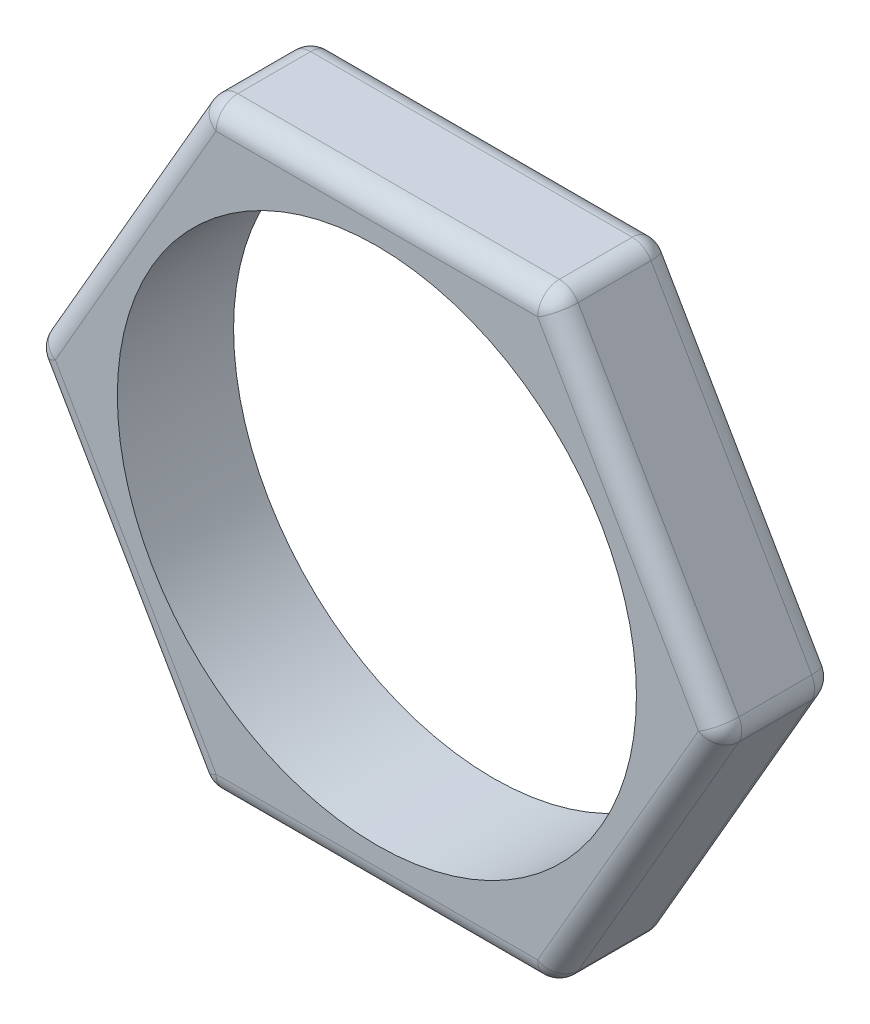
ISO-10303-21;
HEADER;
FILE_DESCRIPTION(('STEP AP214'),'2;1');
FILE_NAME('part.step','',(''),(''),'','','');
FILE_SCHEMA(('AUTOMOTIVE_DESIGN { 1 0 10303 214 1 1 1 1 }'));
ENDSEC;
DATA;
#1=APPLICATION_CONTEXT('core data for automotive mechanical design processes');
#2=APPLICATION_PROTOCOL_DEFINITION('international standard','automotive_design',2000,#1);
#3=PRODUCT_CONTEXT('',#1,'mechanical');
#4=PRODUCT('Part','Part','',(#3));
#5=PRODUCT_RELATED_PRODUCT_CATEGORY('part','',(#4));
#6=PRODUCT_DEFINITION_FORMATION('','',#4);
#7=PRODUCT_DEFINITION_CONTEXT('part definition',#1,'design');
#8=PRODUCT_DEFINITION('design','',#6,#7);
#9=PRODUCT_DEFINITION_SHAPE('','',#8);
#10=(LENGTH_UNIT() NAMED_UNIT(*) SI_UNIT(.MILLI.,.METRE.));
#11=(NAMED_UNIT(*) PLANE_ANGLE_UNIT() SI_UNIT($,.RADIAN.));
#12=(NAMED_UNIT(*) SI_UNIT($,.STERADIAN.) SOLID_ANGLE_UNIT());
#13=UNCERTAINTY_MEASURE_WITH_UNIT(LENGTH_MEASURE(1.E-05),#10,'distance_accuracy_value','');
#14=(GEOMETRIC_REPRESENTATION_CONTEXT(3) GLOBAL_UNCERTAINTY_ASSIGNED_CONTEXT((#13)) GLOBAL_UNIT_ASSIGNED_CONTEXT((#10,
#11,#12)) REPRESENTATION_CONTEXT('',''));
#15=CARTESIAN_POINT('',(0.,0.,0.));
#16=DIRECTION('',(0.,0.,1.));
#17=DIRECTION('',(1.,0.,0.));
#18=AXIS2_PLACEMENT_3D('',#15,#16,#17);
#19=CARTESIAN_POINT('',(5.88420960601336,-10.19175,0.));
#20=DIRECTION('',(0.,0.,-1.));
#21=DIRECTION('',(-1.,0.,0.));
#22=AXIS2_PLACEMENT_3D('',#19,#20,#21);
#23=CYLINDRICAL_SURFACE('',#22,0.79375);
#24=CARTESIAN_POINT('',(5.88420960601336,-10.19175,-0.79375));
#25=DIRECTION('',(0.,0.,-1.));
#26=DIRECTION('',(-1.,0.,0.));
#27=AXIS2_PLACEMENT_3D('',#24,#25,#26);
#28=CIRCLE('',#27,0.79375);
#29=CARTESIAN_POINT('',(5.88420960601336,-10.9855,-0.79375));
#30=VERTEX_POINT('',#29);
#31=CARTESIAN_POINT('',(6.57161727026726,-10.588625,-0.79375));
#32=VERTEX_POINT('',#31);
#33=EDGE_CURVE('E382',#30,#32,#28,.F.);
#34=ORIENTED_EDGE('',*,*,#33,.F.);
#35=DIRECTION('',(0.,0.,-1.));
#36=VECTOR('',#35,1.);
#37=CARTESIAN_POINT('',(5.88420960601336,-10.9855,0.));
#38=LINE('',#37,#36);
#39=CARTESIAN_POINT('',(5.88420960601336,-10.9855,-3.46075));
#40=VERTEX_POINT('',#39);
#41=EDGE_CURVE('E385',#40,#30,#38,.F.);
#42=ORIENTED_EDGE('',*,*,#41,.F.);
#43=CARTESIAN_POINT('',(5.88420960601336,-10.19175,-3.46075));
#44=DIRECTION('',(0.,0.,-1.));
#45=DIRECTION('',(-1.,0.,0.));
#46=AXIS2_PLACEMENT_3D('',#43,#44,#45);
#47=CIRCLE('',#46,0.79375);
#48=CARTESIAN_POINT('',(6.57161727026726,-10.588625,-3.46075));
#49=VERTEX_POINT('',#48);
#50=EDGE_CURVE('E507',#49,#40,#47,.T.);
#51=ORIENTED_EDGE('',*,*,#50,.F.);
#52=DIRECTION('',(0.,0.,1.));
#53=VECTOR('',#52,1.);
#54=CARTESIAN_POINT('',(6.57161727026726,-10.588625,0.));
#55=LINE('',#54,#53);
#56=EDGE_CURVE('E372',#32,#49,#55,.F.);
#57=ORIENTED_EDGE('',*,*,#56,.F.);
#58=EDGE_LOOP('',(#34,#42,#51,#57));
#59=FACE_BOUND('',#58,.T.);
#60=ADVANCED_FACE('F17',(#59),#23,.T.);
#61=CARTESIAN_POINT('',(11.7684192120267,0.,0.));
#62=DIRECTION('',(0.,0.,-1.));
#63=DIRECTION('',(-1.,0.,0.));
#64=AXIS2_PLACEMENT_3D('',#61,#62,#63);
#65=CYLINDRICAL_SURFACE('',#64,0.79375);
#66=CARTESIAN_POINT('',(11.7684192120267,0.,-0.79375));
#67=DIRECTION('',(0.,0.,-1.));
#68=DIRECTION('',(-1.,0.,0.));
#69=AXIS2_PLACEMENT_3D('',#66,#67,#68);
#70=CIRCLE('',#69,0.79375);
#71=CARTESIAN_POINT('',(12.4558268762806,-0.396875000000004,-0.79375));
#72=VERTEX_POINT('',#71);
#73=CARTESIAN_POINT('',(12.4558268762806,0.396874999999995,-0.79375));
#74=VERTEX_POINT('',#73);
#75=EDGE_CURVE('E374',#72,#74,#70,.F.);
#76=ORIENTED_EDGE('',*,*,#75,.F.);
#77=DIRECTION('',(0.,0.,1.));
#78=VECTOR('',#77,1.);
#79=CARTESIAN_POINT('',(12.4558268762806,-0.396875000000005,0.));
#80=LINE('',#79,#78);
#81=CARTESIAN_POINT('',(12.4558268762806,-0.396875000000005,-3.46075));
#82=VERTEX_POINT('',#81);
#83=EDGE_CURVE('E375',#82,#72,#80,.T.);
#84=ORIENTED_EDGE('',*,*,#83,.F.);
#85=CARTESIAN_POINT('',(11.7684192120267,0.,-3.46075));
#86=DIRECTION('',(0.,0.,-1.));
#87=DIRECTION('',(-1.,0.,0.));
#88=AXIS2_PLACEMENT_3D('',#85,#86,#87);
#89=CIRCLE('',#88,0.79375);
#90=CARTESIAN_POINT('',(12.4558268762806,0.396874999999995,-3.46075));
#91=VERTEX_POINT('',#90);
#92=EDGE_CURVE('E453',#91,#82,#89,.T.);
#93=ORIENTED_EDGE('',*,*,#92,.F.);
#94=DIRECTION('',(0.,0.,1.));
#95=VECTOR('',#94,1.);
#96=CARTESIAN_POINT('',(12.4558268762806,0.396874999999994,0.));
#97=LINE('',#96,#95);
#98=EDGE_CURVE('E462',#74,#91,#97,.F.);
#99=ORIENTED_EDGE('',*,*,#98,.F.);
#100=EDGE_LOOP('',(#76,#84,#93,#99));
#101=FACE_BOUND('',#100,.T.);
#102=ADVANCED_FACE('F209',(#101),#65,.T.);
#103=CARTESIAN_POINT('',(5.88420960601336,10.19175,0.));
#104=DIRECTION('',(0.,0.,-1.));
#105=DIRECTION('',(-1.,0.,0.));
#106=AXIS2_PLACEMENT_3D('',#103,#104,#105);
#107=CYLINDRICAL_SURFACE('',#106,0.79375);
#108=CARTESIAN_POINT('',(5.88420960601336,10.19175,-0.79375));
#109=DIRECTION('',(0.,0.,-1.));
#110=DIRECTION('',(-1.,0.,0.));
#111=AXIS2_PLACEMENT_3D('',#108,#109,#110);
#112=CIRCLE('',#111,0.79375);
#113=CARTESIAN_POINT('',(6.57161727026726,10.588625,-0.79375));
#114=VERTEX_POINT('',#113);
#115=CARTESIAN_POINT('',(5.88420960601336,10.9855,-0.79375));
#116=VERTEX_POINT('',#115);
#117=EDGE_CURVE('E348',#114,#116,#112,.F.);
#118=ORIENTED_EDGE('',*,*,#117,.F.);
#119=DIRECTION('',(0.,0.,1.));
#120=VECTOR('',#119,1.);
#121=CARTESIAN_POINT('',(6.57161727026726,10.588625,0.));
#122=LINE('',#121,#120);
#123=CARTESIAN_POINT('',(6.57161727026726,10.588625,-3.46075));
#124=VERTEX_POINT('',#123);
#125=EDGE_CURVE('E370',#124,#114,#122,.T.);
#126=ORIENTED_EDGE('',*,*,#125,.F.);
#127=CARTESIAN_POINT('',(5.88420960601336,10.19175,-3.46075));
#128=DIRECTION('',(0.,0.,-1.));
#129=DIRECTION('',(-1.,0.,0.));
#130=AXIS2_PLACEMENT_3D('',#127,#128,#129);
#131=CIRCLE('',#130,0.79375);
#132=CARTESIAN_POINT('',(5.88420960601336,10.9855,-3.46075));
#133=VERTEX_POINT('',#132);
#134=EDGE_CURVE('E447',#133,#124,#131,.T.);
#135=ORIENTED_EDGE('',*,*,#134,.F.);
#136=DIRECTION('',(0.,0.,1.));
#137=VECTOR('',#136,1.);
#138=CARTESIAN_POINT('',(5.88420960601336,10.9855,0.));
#139=LINE('',#138,#137);
#140=EDGE_CURVE('E340',#116,#133,#139,.F.);
#141=ORIENTED_EDGE('',*,*,#140,.F.);
#142=EDGE_LOOP('',(#118,#126,#135,#141));
#143=FACE_BOUND('',#142,.T.);
#144=ADVANCED_FACE('F206',(#143),#107,.T.);
#145=CARTESIAN_POINT('',(-5.88420960601338,10.19175,0.));
#146=DIRECTION('',(0.,0.,-1.));
#147=DIRECTION('',(-1.,0.,0.));
#148=AXIS2_PLACEMENT_3D('',#145,#146,#147);
#149=CYLINDRICAL_SURFACE('',#148,0.79375);
#150=CARTESIAN_POINT('',(-5.88420960601338,10.19175,-0.79375));
#151=DIRECTION('',(0.,0.,-1.));
#152=DIRECTION('',(-1.,0.,0.));
#153=AXIS2_PLACEMENT_3D('',#150,#151,#152);
#154=CIRCLE('',#153,0.79375);
#155=CARTESIAN_POINT('',(-5.88420960601338,10.9855,-0.79375));
#156=VERTEX_POINT('',#155);
#157=CARTESIAN_POINT('',(-6.57161727026727,10.588625,-0.79375));
#158=VERTEX_POINT('',#157);
#159=EDGE_CURVE('E176',#156,#158,#154,.F.);
#160=ORIENTED_EDGE('',*,*,#159,.F.);
#161=DIRECTION('',(0.,0.,1.));
#162=VECTOR('',#161,1.);
#163=CARTESIAN_POINT('',(-5.88420960601338,10.9855,0.));
#164=LINE('',#163,#162);
#165=CARTESIAN_POINT('',(-5.88420960601338,10.9855,-3.46075));
#166=VERTEX_POINT('',#165);
#167=EDGE_CURVE('E342',#166,#156,#164,.T.);
#168=ORIENTED_EDGE('',*,*,#167,.F.);
#169=CARTESIAN_POINT('',(-5.88420960601338,10.19175,-3.46075));
#170=DIRECTION('',(0.,0.,-1.));
#171=DIRECTION('',(-1.,0.,0.));
#172=AXIS2_PLACEMENT_3D('',#169,#170,#171);
#173=CIRCLE('',#172,0.79375);
#174=CARTESIAN_POINT('',(-6.57161727026726,10.588625,-3.46075));
#175=VERTEX_POINT('',#174);
#176=EDGE_CURVE('E159',#175,#166,#173,.T.);
#177=ORIENTED_EDGE('',*,*,#176,.F.);
#178=DIRECTION('',(0.,0.,1.));
#179=VECTOR('',#178,1.);
#180=CARTESIAN_POINT('',(-6.57161727026726,10.588625,0.));
#181=LINE('',#180,#179);
#182=EDGE_CURVE('E175',#158,#175,#181,.F.);
#183=ORIENTED_EDGE('',*,*,#182,.F.);
#184=EDGE_LOOP('',(#160,#168,#177,#183));
#185=FACE_BOUND('',#184,.T.);
#186=ADVANCED_FACE('F202',(#185),#149,.T.);
#187=CARTESIAN_POINT('',(-5.88420960601336,-10.19175,0.));
#188=DIRECTION('',(0.,0.,-1.));
#189=DIRECTION('',(-1.,0.,0.));
#190=AXIS2_PLACEMENT_3D('',#187,#188,#189);
#191=CYLINDRICAL_SURFACE('',#190,0.79375);
#192=CARTESIAN_POINT('',(-5.88420960601336,-10.19175,-0.79375));
#193=DIRECTION('',(0.,0.,-1.));
#194=DIRECTION('',(-1.,0.,0.));
#195=AXIS2_PLACEMENT_3D('',#192,#193,#194);
#196=CIRCLE('',#195,0.79375);
#197=CARTESIAN_POINT('',(-6.57161727026727,-10.588625,-0.79375));
#198=VERTEX_POINT('',#197);
#199=CARTESIAN_POINT('',(-5.88420960601336,-10.9855,-0.79375));
#200=VERTEX_POINT('',#199);
#201=EDGE_CURVE('E501',#198,#200,#196,.F.);
#202=ORIENTED_EDGE('',*,*,#201,.F.);
#203=DIRECTION('',(0.,0.,1.));
#204=VECTOR('',#203,1.);
#205=CARTESIAN_POINT('',(-6.57161727026726,-10.588625,0.));
#206=LINE('',#205,#204);
#207=CARTESIAN_POINT('',(-6.57161727026727,-10.588625,-3.46075));
#208=VERTEX_POINT('',#207);
#209=EDGE_CURVE('E302',#208,#198,#206,.T.);
#210=ORIENTED_EDGE('',*,*,#209,.F.);
#211=CARTESIAN_POINT('',(-5.88420960601336,-10.19175,-3.46075));
#212=DIRECTION('',(0.,0.,-1.));
#213=DIRECTION('',(-1.,0.,0.));
#214=AXIS2_PLACEMENT_3D('',#211,#212,#213);
#215=CIRCLE('',#214,0.79375);
#216=CARTESIAN_POINT('',(-5.88420960601336,-10.9855,-3.46075));
#217=VERTEX_POINT('',#216);
#218=EDGE_CURVE('E392',#217,#208,#215,.T.);
#219=ORIENTED_EDGE('',*,*,#218,.F.);
#220=DIRECTION('',(0.,0.,-1.));
#221=VECTOR('',#220,1.);
#222=CARTESIAN_POINT('',(-5.88420960601336,-10.9855,0.));
#223=LINE('',#222,#221);
#224=EDGE_CURVE('E383',#200,#217,#223,.T.);
#225=ORIENTED_EDGE('',*,*,#224,.F.);
#226=EDGE_LOOP('',(#202,#210,#219,#225));
#227=FACE_BOUND('',#226,.T.);
#228=ADVANCED_FACE('F199',(#227),#191,.T.);
#229=CARTESIAN_POINT('',(-11.7684192120267,0.,0.));
#230=DIRECTION('',(0.,0.,-1.));
#231=DIRECTION('',(-1.,0.,0.));
#232=AXIS2_PLACEMENT_3D('',#229,#230,#231);
#233=CYLINDRICAL_SURFACE('',#232,0.79375);
#234=CARTESIAN_POINT('',(-11.7684192120267,0.,-0.79375));
#235=DIRECTION('',(0.,0.,-1.));
#236=DIRECTION('',(-1.,0.,0.));
#237=AXIS2_PLACEMENT_3D('',#234,#235,#236);
#238=CIRCLE('',#237,0.79375);
#239=CARTESIAN_POINT('',(-12.4558268762806,0.396874999999993,-0.79375));
#240=VERTEX_POINT('',#239);
#241=CARTESIAN_POINT('',(-12.4558268762806,-0.396875000000001,-0.79375));
#242=VERTEX_POINT('',#241);
#243=EDGE_CURVE('E172',#240,#242,#238,.F.);
#244=ORIENTED_EDGE('',*,*,#243,.F.);
#245=DIRECTION('',(0.,0.,1.));
#246=VECTOR('',#245,1.);
#247=CARTESIAN_POINT('',(-12.4558268762806,0.396874999999995,0.));
#248=LINE('',#247,#246);
#249=CARTESIAN_POINT('',(-12.4558268762806,0.396874999999992,-3.46075));
#250=VERTEX_POINT('',#249);
#251=EDGE_CURVE('E170',#250,#240,#248,.T.);
#252=ORIENTED_EDGE('',*,*,#251,.F.);
#253=CARTESIAN_POINT('',(-11.7684192120267,0.,-3.46075));
#254=DIRECTION('',(0.,0.,-1.));
#255=DIRECTION('',(-1.,0.,0.));
#256=AXIS2_PLACEMENT_3D('',#253,#254,#255);
#257=CIRCLE('',#256,0.79375);
#258=CARTESIAN_POINT('',(-12.4558268762806,-0.396875000000002,-3.46075));
#259=VERTEX_POINT('',#258);
#260=EDGE_CURVE('E20',#259,#250,#257,.T.);
#261=ORIENTED_EDGE('',*,*,#260,.F.);
#262=DIRECTION('',(0.,0.,1.));
#263=VECTOR('',#262,1.);
#264=CARTESIAN_POINT('',(-12.4558268762806,-0.396875000000003,0.));
#265=LINE('',#264,#263);
#266=EDGE_CURVE('E145',#242,#259,#265,.F.);
#267=ORIENTED_EDGE('',*,*,#266,.F.);
#268=EDGE_LOOP('',(#244,#252,#261,#267));
#269=FACE_BOUND('',#268,.T.);
#270=ADVANCED_FACE('F171',(#269),#233,.T.);
#271=CARTESIAN_POINT('',(-11.7684192120267,0.,-3.46075));
#272=DIRECTION('',(-0.866025403784439,0.,-0.5));
#273=DIRECTION('',(0.,1.,0.));
#274=AXIS2_PLACEMENT_3D('',#271,#272,#273);
#275=SPHERICAL_SURFACE('',#274,0.79375);
#276=CARTESIAN_POINT('',(-12.4558268762806,0.,-3.857625));
#277=VERTEX_POINT('',#276);
#278=VERTEX_LOOP('',#277);
#279=FACE_BOUND('',#278,.T.);
#280=ORIENTED_EDGE('',*,*,#260,.T.);
#281=CARTESIAN_POINT('',(-11.7684192120267,0.,-3.46075));
#282=DIRECTION('',(0.5,0.866025403784439,0.));
#283=DIRECTION('',(-0.866025403784439,0.5,0.));
#284=AXIS2_PLACEMENT_3D('',#281,#282,#283);
#285=CIRCLE('',#284,0.79375);
#286=CARTESIAN_POINT('',(-11.7684192120267,0.,-4.2545));
#287=VERTEX_POINT('',#286);
#288=EDGE_CURVE('E154',#287,#250,#285,.T.);
#289=ORIENTED_EDGE('',*,*,#288,.F.);
#290=CARTESIAN_POINT('',(-11.7684192120267,0.,-3.46075));
#291=DIRECTION('',(-0.5,0.866025403784439,0.));
#292=DIRECTION('',(-0.866025403784439,-0.5,0.));
#293=AXIS2_PLACEMENT_3D('',#290,#291,#292);
#294=CIRCLE('',#293,0.79375);
#295=EDGE_CURVE('E156',#259,#287,#294,.F.);
#296=ORIENTED_EDGE('',*,*,#295,.F.);
#297=EDGE_LOOP('',(#280,#289,#296));
#298=FACE_BOUND('',#297,.T.);
#299=ADVANCED_FACE('F153',(#279,#298),#275,.T.);
#300=CARTESIAN_POINT('',(-5.88420960601338,10.19175,-3.46075));
#301=DIRECTION('',(-0.43301270189222,0.75,-0.499999999999999));
#302=DIRECTION('',(0.,-0.554700196225228,-0.832050294337844));
#303=AXIS2_PLACEMENT_3D('',#300,#301,#302);
#304=SPHERICAL_SURFACE('',#303,0.79375);
#305=CARTESIAN_POINT('',(-6.22791343814033,10.7870625,-3.857625));
#306=VERTEX_POINT('',#305);
#307=VERTEX_LOOP('',#306);
#308=FACE_BOUND('',#307,.T.);
#309=ORIENTED_EDGE('',*,*,#176,.T.);
#310=CARTESIAN_POINT('',(-5.88420960601338,10.19175,-3.46075));
#311=DIRECTION('',(1.,0.,0.));
#312=DIRECTION('',(0.,1.,0.));
#313=AXIS2_PLACEMENT_3D('',#310,#311,#312);
#314=CIRCLE('',#313,0.79375);
#315=CARTESIAN_POINT('',(-5.88420960601338,10.19175,-4.2545));
#316=VERTEX_POINT('',#315);
#317=EDGE_CURVE('E182',#316,#166,#314,.T.);
#318=ORIENTED_EDGE('',*,*,#317,.F.);
#319=CARTESIAN_POINT('',(-5.88420960601336,10.19175,-3.46075));
#320=DIRECTION('',(0.5,0.866025403784439,0.));
#321=DIRECTION('',(-0.866025403784439,0.5,0.));
#322=AXIS2_PLACEMENT_3D('',#319,#320,#321);
#323=CIRCLE('',#322,0.79375);
#324=EDGE_CURVE('E180',#175,#316,#323,.F.);
#325=ORIENTED_EDGE('',*,*,#324,.F.);
#326=EDGE_LOOP('',(#309,#318,#325));
#327=FACE_BOUND('',#326,.T.);
#328=ADVANCED_FACE('F194',(#308,#327),#304,.T.);
#329=CARTESIAN_POINT('',(5.88420960601336,10.19175,-3.46075));
#330=DIRECTION('',(0.43301270189222,0.75,-0.499999999999999));
#331=DIRECTION('',(0.,-0.554700196225228,-0.832050294337844));
#332=AXIS2_PLACEMENT_3D('',#329,#330,#331);
#333=SPHERICAL_SURFACE('',#332,0.79375);
#334=CARTESIAN_POINT('',(6.22791343814031,10.7870625,-3.857625));
#335=VERTEX_POINT('',#334);
#336=VERTEX_LOOP('',#335);
#337=FACE_BOUND('',#336,.T.);
#338=ORIENTED_EDGE('',*,*,#134,.T.);
#339=CARTESIAN_POINT('',(5.88420960601335,10.19175,-3.46075));
#340=DIRECTION('',(0.5,-0.866025403784439,0.));
#341=DIRECTION('',(0.866025403784439,0.5,0.));
#342=AXIS2_PLACEMENT_3D('',#339,#340,#341);
#343=CIRCLE('',#342,0.79375);
#344=CARTESIAN_POINT('',(5.88420960601336,10.19175,-4.2545));
#345=VERTEX_POINT('',#344);
#346=EDGE_CURVE('E428',#345,#124,#343,.T.);
#347=ORIENTED_EDGE('',*,*,#346,.F.);
#348=CARTESIAN_POINT('',(5.88420960601336,10.19175,-3.46075));
#349=DIRECTION('',(1.,0.,0.));
#350=DIRECTION('',(0.,1.,0.));
#351=AXIS2_PLACEMENT_3D('',#348,#349,#350);
#352=CIRCLE('',#351,0.79375);
#353=EDGE_CURVE('E450',#133,#345,#352,.F.);
#354=ORIENTED_EDGE('',*,*,#353,.F.);
#355=EDGE_LOOP('',(#338,#347,#354));
#356=FACE_BOUND('',#355,.T.);
#357=ADVANCED_FACE('F432',(#337,#356),#333,.T.);
#358=CARTESIAN_POINT('',(11.7684192120267,0.,-3.46075));
#359=DIRECTION('',(0.866025403784439,0.,-0.5));
#360=DIRECTION('',(0.,-1.,0.));
#361=AXIS2_PLACEMENT_3D('',#358,#359,#360);
#362=SPHERICAL_SURFACE('',#361,0.79375);
#363=CARTESIAN_POINT('',(12.4558268762806,0.,-3.857625));
#364=VERTEX_POINT('',#363);
#365=VERTEX_LOOP('',#364);
#366=FACE_BOUND('',#365,.T.);
#367=ORIENTED_EDGE('',*,*,#92,.T.);
#368=CARTESIAN_POINT('',(11.7684192120267,0.,-3.46075));
#369=DIRECTION('',(-0.5,-0.866025403784439,0.));
#370=DIRECTION('',(0.866025403784439,-0.5,0.));
#371=AXIS2_PLACEMENT_3D('',#368,#369,#370);
#372=CIRCLE('',#371,0.79375);
#373=CARTESIAN_POINT('',(11.7684192120267,0.,-4.2545));
#374=VERTEX_POINT('',#373);
#375=EDGE_CURVE('E418',#374,#82,#372,.T.);
#376=ORIENTED_EDGE('',*,*,#375,.F.);
#377=CARTESIAN_POINT('',(11.7684192120267,0.,-3.46075));
#378=DIRECTION('',(0.5,-0.866025403784439,0.));
#379=DIRECTION('',(0.866025403784439,0.5,0.));
#380=AXIS2_PLACEMENT_3D('',#377,#378,#379);
#381=CIRCLE('',#380,0.79375);
#382=EDGE_CURVE('E427',#91,#374,#381,.F.);
#383=ORIENTED_EDGE('',*,*,#382,.F.);
#384=EDGE_LOOP('',(#367,#376,#383));
#385=FACE_BOUND('',#384,.T.);
#386=ADVANCED_FACE('F405',(#366,#385),#362,.T.);
#387=CARTESIAN_POINT('',(5.88420960601336,-10.19175,-3.46075));
#388=DIRECTION('',(0.43301270189222,-0.75,-0.5));
#389=DIRECTION('',(0.,-0.554700196225229,0.832050294337844));
#390=AXIS2_PLACEMENT_3D('',#387,#388,#389);
#391=SPHERICAL_SURFACE('',#390,0.79375);
#392=CARTESIAN_POINT('',(6.22791343814031,-10.7870625,-3.857625));
#393=VERTEX_POINT('',#392);
#394=VERTEX_LOOP('',#393);
#395=FACE_BOUND('',#394,.T.);
#396=ORIENTED_EDGE('',*,*,#50,.T.);
#397=CARTESIAN_POINT('',(5.88420960601336,-10.19175,-3.46075));
#398=DIRECTION('',(-1.,0.,0.));
#399=DIRECTION('',(0.,0.,1.));
#400=AXIS2_PLACEMENT_3D('',#397,#398,#399);
#401=CIRCLE('',#400,0.79375);
#402=CARTESIAN_POINT('',(5.88420960601336,-10.19175,-4.2545));
#403=VERTEX_POINT('',#402);
#404=EDGE_CURVE('E486',#403,#40,#401,.T.);
#405=ORIENTED_EDGE('',*,*,#404,.F.);
#406=CARTESIAN_POINT('',(5.88420960601337,-10.19175,-3.46075));
#407=DIRECTION('',(-0.5,-0.866025403784439,0.));
#408=DIRECTION('',(0.866025403784439,-0.5,0.));
#409=AXIS2_PLACEMENT_3D('',#406,#407,#408);
#410=CIRCLE('',#409,0.79375);
#411=EDGE_CURVE('E417',#49,#403,#410,.F.);
#412=ORIENTED_EDGE('',*,*,#411,.F.);
#413=EDGE_LOOP('',(#396,#405,#412));
#414=FACE_BOUND('',#413,.T.);
#415=ADVANCED_FACE('F400',(#395,#414),#391,.T.);
#416=CARTESIAN_POINT('',(-5.88420960601336,-10.19175,-3.46075));
#417=DIRECTION('',(-0.43301270189222,-0.75,-0.5));
#418=DIRECTION('',(0.,-0.554700196225229,0.832050294337844));
#419=AXIS2_PLACEMENT_3D('',#416,#417,#418);
#420=SPHERICAL_SURFACE('',#419,0.79375);
#421=CARTESIAN_POINT('',(-6.22791343814031,-10.7870625,-3.857625));
#422=VERTEX_POINT('',#421);
#423=VERTEX_LOOP('',#422);
#424=FACE_BOUND('',#423,.T.);
#425=ORIENTED_EDGE('',*,*,#218,.T.);
#426=CARTESIAN_POINT('',(-5.88420960601337,-10.19175,-3.46075));
#427=DIRECTION('',(-0.5,0.866025403784439,0.));
#428=DIRECTION('',(-0.866025403784439,-0.5,0.));
#429=AXIS2_PLACEMENT_3D('',#426,#427,#428);
#430=CIRCLE('',#429,0.79375);
#431=CARTESIAN_POINT('',(-5.88420960601336,-10.19175,-4.2545));
#432=VERTEX_POINT('',#431);
#433=EDGE_CURVE('E301',#432,#208,#430,.T.);
#434=ORIENTED_EDGE('',*,*,#433,.F.);
#435=CARTESIAN_POINT('',(-5.88420960601336,-10.19175,-3.46075));
#436=DIRECTION('',(-1.,0.,0.));
#437=DIRECTION('',(0.,0.,1.));
#438=AXIS2_PLACEMENT_3D('',#435,#436,#437);
#439=CIRCLE('',#438,0.79375);
#440=EDGE_CURVE('E484',#217,#432,#439,.F.);
#441=ORIENTED_EDGE('',*,*,#440,.F.);
#442=EDGE_LOOP('',(#425,#434,#441));
#443=FACE_BOUND('',#442,.T.);
#444=ADVANCED_FACE('F397',(#424,#443),#420,.T.);
#445=CARTESIAN_POINT('',(6.34248138218263,-10.9855,0.));
#446=DIRECTION('',(0.,-1.,0.));
#447=DIRECTION('',(0.,0.,-1.));
#448=AXIS2_PLACEMENT_3D('',#445,#446,#447);
#449=PLANE('',#448);
#450=DIRECTION('',(-1.,0.,0.));
#451=VECTOR('',#450,1.);
#452=CARTESIAN_POINT('',(3.1712406910913,-10.9855,-0.79375));
#453=LINE('',#452,#451);
#454=EDGE_CURVE('E386',#200,#30,#453,.F.);
#455=ORIENTED_EDGE('',*,*,#454,.F.);
#456=ORIENTED_EDGE('',*,*,#224,.T.);
#457=DIRECTION('',(-1.,0.,0.));
#458=VECTOR('',#457,1.);
#459=CARTESIAN_POINT('',(3.1712406910913,-10.9855,-3.46075));
#460=LINE('',#459,#458);
#461=EDGE_CURVE('E395',#40,#217,#460,.T.);
#462=ORIENTED_EDGE('',*,*,#461,.F.);
#463=ORIENTED_EDGE('',*,*,#41,.T.);
#464=EDGE_LOOP('',(#455,#456,#462,#463));
#465=FACE_BOUND('',#464,.T.);
#466=ADVANCED_FACE('F364',(#465),#449,.T.);
#467=CARTESIAN_POINT('',(5.88420960601336,-10.19175,-0.79375));
#468=DIRECTION('',(0.43301270189222,-0.75,0.499999999999999));
#469=DIRECTION('',(0.,0.554700196225228,0.832050294337844));
#470=AXIS2_PLACEMENT_3D('',#467,#468,#469);
#471=SPHERICAL_SURFACE('',#470,0.79375);
#472=CARTESIAN_POINT('',(6.22791343814031,-10.7870625,-0.396875000000001));
#473=VERTEX_POINT('',#472);
#474=VERTEX_LOOP('',#473);
#475=FACE_BOUND('',#474,.T.);
#476=ORIENTED_EDGE('',*,*,#33,.T.);
#477=CARTESIAN_POINT('',(5.88420960601336,-10.19175,-0.79375));
#478=DIRECTION('',(-0.5,-0.866025403784439,0.));
#479=DIRECTION('',(0.866025403784439,-0.5,0.));
#480=AXIS2_PLACEMENT_3D('',#477,#478,#479);
#481=CIRCLE('',#480,0.79375);
#482=CARTESIAN_POINT('',(5.88420960601336,-10.19175,0.));
#483=VERTEX_POINT('',#482);
#484=EDGE_CURVE('E380',#483,#32,#481,.F.);
#485=ORIENTED_EDGE('',*,*,#484,.F.);
#486=CARTESIAN_POINT('',(5.88420960601336,-10.19175,-0.79375));
#487=DIRECTION('',(-1.,0.,0.));
#488=DIRECTION('',(0.,0.,1.));
#489=AXIS2_PLACEMENT_3D('',#486,#487,#488);
#490=CIRCLE('',#489,0.79375);
#491=EDGE_CURVE('E482',#30,#483,#490,.T.);
#492=ORIENTED_EDGE('',*,*,#491,.F.);
#493=EDGE_LOOP('',(#476,#485,#492));
#494=FACE_BOUND('',#493,.T.);
#495=ADVANCED_FACE('F359',(#475,#494),#471,.T.);
#496=CARTESIAN_POINT('',(12.6849627643653,0.,0.));
#497=DIRECTION('',(0.866025403784439,-0.5,0.));
#498=DIRECTION('',(0.5,0.866025403784439,0.));
#499=AXIS2_PLACEMENT_3D('',#496,#497,#498);
#500=PLANE('',#499);
#501=DIRECTION('',(-0.5,-0.866025403784439,0.));
#502=VECTOR('',#501,1.);
#503=CARTESIAN_POINT('',(11.0993424188196,-2.746375,-0.79375));
#504=LINE('',#503,#502);
#505=EDGE_CURVE('E376',#32,#72,#504,.F.);
#506=ORIENTED_EDGE('',*,*,#505,.F.);
#507=ORIENTED_EDGE('',*,*,#56,.T.);
#508=DIRECTION('',(-0.5,-0.866025403784439,0.));
#509=VECTOR('',#508,1.);
#510=CARTESIAN_POINT('',(11.0993424188196,-2.746375,-3.46075));
#511=LINE('',#510,#509);
#512=EDGE_CURVE('E415',#82,#49,#511,.T.);
#513=ORIENTED_EDGE('',*,*,#512,.F.);
#514=ORIENTED_EDGE('',*,*,#83,.T.);
#515=EDGE_LOOP('',(#506,#507,#513,#514));
#516=FACE_BOUND('',#515,.T.);
#517=ADVANCED_FACE('F355',(#516),#500,.T.);
#518=CARTESIAN_POINT('',(11.7684192120267,0.,-0.79375));
#519=DIRECTION('',(0.866025403784439,0.,0.5));
#520=DIRECTION('',(0.,-1.,0.));
#521=AXIS2_PLACEMENT_3D('',#518,#519,#520);
#522=SPHERICAL_SURFACE('',#521,0.79375);
#523=CARTESIAN_POINT('',(12.4558268762806,0.,-0.396875));
#524=VERTEX_POINT('',#523);
#525=VERTEX_LOOP('',#524);
#526=FACE_BOUND('',#525,.T.);
#527=ORIENTED_EDGE('',*,*,#75,.T.);
#528=CARTESIAN_POINT('',(11.7684192120267,0.,-0.79375));
#529=DIRECTION('',(0.5,-0.866025403784439,0.));
#530=DIRECTION('',(0.866025403784439,0.5,0.));
#531=AXIS2_PLACEMENT_3D('',#528,#529,#530);
#532=CIRCLE('',#531,0.79375);
#533=CARTESIAN_POINT('',(11.7684192120267,0.,0.));
#534=VERTEX_POINT('',#533);
#535=EDGE_CURVE('E467',#534,#74,#532,.F.);
#536=ORIENTED_EDGE('',*,*,#535,.F.);
#537=CARTESIAN_POINT('',(11.7684192120267,0.,-0.79375));
#538=DIRECTION('',(-0.5,-0.866025403784439,0.));
#539=DIRECTION('',(0.866025403784439,-0.5,0.));
#540=AXIS2_PLACEMENT_3D('',#537,#538,#539);
#541=CIRCLE('',#540,0.79375);
#542=EDGE_CURVE('E389',#72,#534,#541,.T.);
#543=ORIENTED_EDGE('',*,*,#542,.F.);
#544=EDGE_LOOP('',(#527,#536,#543));
#545=FACE_BOUND('',#544,.T.);
#546=ADVANCED_FACE('F352',(#526,#545),#522,.T.);
#547=CARTESIAN_POINT('',(6.34248138218263,10.9855,0.));
#548=DIRECTION('',(0.866025403784439,0.5,0.));
#549=DIRECTION('',(-0.5,0.866025403784439,0.));
#550=AXIS2_PLACEMENT_3D('',#547,#548,#549);
#551=PLANE('',#550);
#552=DIRECTION('',(0.5,-0.866025403784439,0.));
#553=VECTOR('',#552,1.);
#554=CARTESIAN_POINT('',(7.92810172772827,8.239125,-0.79375));
#555=LINE('',#554,#553);
#556=EDGE_CURVE('E464',#74,#114,#555,.F.);
#557=ORIENTED_EDGE('',*,*,#556,.F.);
#558=ORIENTED_EDGE('',*,*,#98,.T.);
#559=DIRECTION('',(0.5,-0.866025403784439,0.));
#560=VECTOR('',#559,1.);
#561=CARTESIAN_POINT('',(7.92810172772827,8.239125,-3.46075));
#562=LINE('',#561,#560);
#563=EDGE_CURVE('E424',#124,#91,#562,.T.);
#564=ORIENTED_EDGE('',*,*,#563,.F.);
#565=ORIENTED_EDGE('',*,*,#125,.T.);
#566=EDGE_LOOP('',(#557,#558,#564,#565));
#567=FACE_BOUND('',#566,.T.);
#568=ADVANCED_FACE('F331',(#567),#551,.T.);
#569=CARTESIAN_POINT('',(5.88420960601336,10.19175,-0.79375));
#570=DIRECTION('',(0.43301270189222,0.75,0.499999999999999));
#571=DIRECTION('',(0.,0.554700196225228,-0.832050294337844));
#572=AXIS2_PLACEMENT_3D('',#569,#570,#571);
#573=SPHERICAL_SURFACE('',#572,0.79375);
#574=CARTESIAN_POINT('',(6.22791343814031,10.7870625,-0.396875000000001));
#575=VERTEX_POINT('',#574);
#576=VERTEX_LOOP('',#575);
#577=FACE_BOUND('',#576,.T.);
#578=ORIENTED_EDGE('',*,*,#117,.T.);
#579=CARTESIAN_POINT('',(5.88420960601336,10.19175,-0.79375));
#580=DIRECTION('',(1.,0.,0.));
#581=DIRECTION('',(0.,1.,0.));
#582=AXIS2_PLACEMENT_3D('',#579,#580,#581);
#583=CIRCLE('',#582,0.79375);
#584=CARTESIAN_POINT('',(5.88420960601336,10.19175,0.));
#585=VERTEX_POINT('',#584);
#586=EDGE_CURVE('E346',#585,#116,#583,.F.);
#587=ORIENTED_EDGE('',*,*,#586,.F.);
#588=CARTESIAN_POINT('',(5.88420960601335,10.19175,-0.79375));
#589=DIRECTION('',(0.5,-0.866025403784439,0.));
#590=DIRECTION('',(0.866025403784439,0.5,0.));
#591=AXIS2_PLACEMENT_3D('',#588,#589,#590);
#592=CIRCLE('',#591,0.79375);
#593=EDGE_CURVE('E379',#114,#585,#592,.T.);
#594=ORIENTED_EDGE('',*,*,#593,.F.);
#595=EDGE_LOOP('',(#578,#587,#594));
#596=FACE_BOUND('',#595,.T.);
#597=ADVANCED_FACE('F326',(#577,#596),#573,.T.);
#598=CARTESIAN_POINT('',(-6.34248138218263,10.9855,0.));
#599=DIRECTION('',(0.,1.,0.));
#600=DIRECTION('',(-1.,0.,0.));
#601=AXIS2_PLACEMENT_3D('',#598,#599,#600);
#602=PLANE('',#601);
#603=DIRECTION('',(1.,0.,0.));
#604=VECTOR('',#603,1.);
#605=CARTESIAN_POINT('',(-3.17124069109133,10.9855,-0.79375));
#606=LINE('',#605,#604);
#607=EDGE_CURVE('E343',#116,#156,#606,.F.);
#608=ORIENTED_EDGE('',*,*,#607,.F.);
#609=ORIENTED_EDGE('',*,*,#140,.T.);
#610=DIRECTION('',(1.,0.,0.));
#611=VECTOR('',#610,1.);
#612=CARTESIAN_POINT('',(-3.17124069109133,10.9855,-3.46075));
#613=LINE('',#612,#611);
#614=EDGE_CURVE('E494',#166,#133,#613,.T.);
#615=ORIENTED_EDGE('',*,*,#614,.F.);
#616=ORIENTED_EDGE('',*,*,#167,.T.);
#617=EDGE_LOOP('',(#608,#609,#615,#616));
#618=FACE_BOUND('',#617,.T.);
#619=ADVANCED_FACE('F322',(#618),#602,.T.);
#620=CARTESIAN_POINT('',(-5.88420960601338,10.19175,-0.79375));
#621=DIRECTION('',(-0.43301270189222,0.75,0.5));
#622=DIRECTION('',(0.,0.554700196225229,-0.832050294337844));
#623=AXIS2_PLACEMENT_3D('',#620,#621,#622);
#624=SPHERICAL_SURFACE('',#623,0.79375);
#625=CARTESIAN_POINT('',(-6.22791343814033,10.7870625,-0.396875));
#626=VERTEX_POINT('',#625);
#627=VERTEX_LOOP('',#626);
#628=FACE_BOUND('',#627,.T.);
#629=ORIENTED_EDGE('',*,*,#159,.T.);
#630=CARTESIAN_POINT('',(-5.88420960601337,10.19175,-0.79375));
#631=DIRECTION('',(0.5,0.866025403784439,0.));
#632=DIRECTION('',(-0.866025403784439,0.5,0.));
#633=AXIS2_PLACEMENT_3D('',#630,#631,#632);
#634=CIRCLE('',#633,0.79375);
#635=CARTESIAN_POINT('',(-5.88420960601338,10.19175,0.));
#636=VERTEX_POINT('',#635);
#637=EDGE_CURVE('E528',#636,#158,#634,.F.);
#638=ORIENTED_EDGE('',*,*,#637,.F.);
#639=CARTESIAN_POINT('',(-5.88420960601338,10.19175,-0.79375));
#640=DIRECTION('',(1.,0.,0.));
#641=DIRECTION('',(0.,1.,0.));
#642=AXIS2_PLACEMENT_3D('',#639,#640,#641);
#643=CIRCLE('',#642,0.79375);
#644=EDGE_CURVE('E466',#156,#636,#643,.T.);
#645=ORIENTED_EDGE('',*,*,#644,.F.);
#646=EDGE_LOOP('',(#629,#638,#645));
#647=FACE_BOUND('',#646,.T.);
#648=ADVANCED_FACE('F319',(#628,#647),#624,.T.);
#649=CARTESIAN_POINT('',(-12.6849627643653,0.,0.));
#650=DIRECTION('',(-0.866025403784439,0.5,0.));
#651=DIRECTION('',(-0.5,-0.866025403784439,0.));
#652=AXIS2_PLACEMENT_3D('',#649,#650,#651);
#653=PLANE('',#652);
#654=DIRECTION('',(0.5,0.866025403784439,0.));
#655=VECTOR('',#654,1.);
#656=CARTESIAN_POINT('',(-11.0993424188196,2.74637499999999,-0.79375));
#657=LINE('',#656,#655);
#658=EDGE_CURVE('E529',#158,#240,#657,.F.);
#659=ORIENTED_EDGE('',*,*,#658,.F.);
#660=ORIENTED_EDGE('',*,*,#182,.T.);
#661=DIRECTION('',(0.5,0.866025403784439,0.));
#662=VECTOR('',#661,1.);
#663=CARTESIAN_POINT('',(-11.0993424188196,2.74637499999999,-3.46075));
#664=LINE('',#663,#662);
#665=EDGE_CURVE('E164',#250,#175,#664,.T.);
#666=ORIENTED_EDGE('',*,*,#665,.F.);
#667=ORIENTED_EDGE('',*,*,#251,.T.);
#668=EDGE_LOOP('',(#659,#660,#666,#667));
#669=FACE_BOUND('',#668,.T.);
#670=ADVANCED_FACE('F178',(#669),#653,.T.);
#671=CARTESIAN_POINT('',(-5.88420960601336,-10.19175,-0.79375));
#672=DIRECTION('',(-0.43301270189222,-0.75,0.5));
#673=DIRECTION('',(0.,0.554700196225229,0.832050294337844));
#674=AXIS2_PLACEMENT_3D('',#671,#672,#673);
#675=SPHERICAL_SURFACE('',#674,0.79375);
#676=CARTESIAN_POINT('',(-6.22791343814031,-10.7870625,-0.396875));
#677=VERTEX_POINT('',#676);
#678=VERTEX_LOOP('',#677);
#679=FACE_BOUND('',#678,.T.);
#680=ORIENTED_EDGE('',*,*,#201,.T.);
#681=CARTESIAN_POINT('',(-5.88420960601336,-10.19175,-0.79375));
#682=DIRECTION('',(-1.,0.,0.));
#683=DIRECTION('',(0.,0.,1.));
#684=AXIS2_PLACEMENT_3D('',#681,#682,#683);
#685=CIRCLE('',#684,0.79375);
#686=CARTESIAN_POINT('',(-5.88420960601336,-10.19175,0.));
#687=VERTEX_POINT('',#686);
#688=EDGE_CURVE('E390',#687,#200,#685,.F.);
#689=ORIENTED_EDGE('',*,*,#688,.F.);
#690=CARTESIAN_POINT('',(-5.88420960601337,-10.19175,-0.79375));
#691=DIRECTION('',(-0.5,0.866025403784439,0.));
#692=DIRECTION('',(-0.866025403784439,-0.5,0.));
#693=AXIS2_PLACEMENT_3D('',#690,#691,#692);
#694=CIRCLE('',#693,0.79375);
#695=EDGE_CURVE('E537',#198,#687,#694,.T.);
#696=ORIENTED_EDGE('',*,*,#695,.F.);
#697=EDGE_LOOP('',(#680,#689,#696));
#698=FACE_BOUND('',#697,.T.);
#699=ADVANCED_FACE('F288',(#679,#698),#675,.T.);
#700=CARTESIAN_POINT('',(-11.7684192120267,0.,-0.79375));
#701=DIRECTION('',(-0.866025403784439,0.,0.5));
#702=DIRECTION('',(0.,1.,0.));
#703=AXIS2_PLACEMENT_3D('',#700,#701,#702);
#704=SPHERICAL_SURFACE('',#703,0.79375);
#705=CARTESIAN_POINT('',(-12.4558268762806,0.,-0.396875));
#706=VERTEX_POINT('',#705);
#707=VERTEX_LOOP('',#706);
#708=FACE_BOUND('',#707,.T.);
#709=ORIENTED_EDGE('',*,*,#243,.T.);
#710=CARTESIAN_POINT('',(-11.7684192120267,0.,-0.79375));
#711=DIRECTION('',(-0.5,0.866025403784439,0.));
#712=DIRECTION('',(-0.866025403784439,-0.5,0.));
#713=AXIS2_PLACEMENT_3D('',#710,#711,#712);
#714=CIRCLE('',#713,0.79375);
#715=CARTESIAN_POINT('',(-11.7684192120267,0.,0.));
#716=VERTEX_POINT('',#715);
#717=EDGE_CURVE('E306',#716,#242,#714,.F.);
#718=ORIENTED_EDGE('',*,*,#717,.F.);
#719=CARTESIAN_POINT('',(-11.7684192120267,0.,-0.79375));
#720=DIRECTION('',(0.5,0.866025403784439,0.));
#721=DIRECTION('',(-0.866025403784439,0.5,0.));
#722=AXIS2_PLACEMENT_3D('',#719,#720,#721);
#723=CIRCLE('',#722,0.79375);
#724=EDGE_CURVE('E35',#240,#716,#723,.T.);
#725=ORIENTED_EDGE('',*,*,#724,.F.);
#726=EDGE_LOOP('',(#709,#718,#725));
#727=FACE_BOUND('',#726,.T.);
#728=ADVANCED_FACE('F284',(#708,#727),#704,.T.);
#729=CARTESIAN_POINT('',(-6.34248138218263,-10.9855,0.));
#730=DIRECTION('',(-0.866025403784439,-0.5,0.));
#731=DIRECTION('',(0.5,-0.866025403784439,0.));
#732=AXIS2_PLACEMENT_3D('',#729,#730,#731);
#733=PLANE('',#732);
#734=DIRECTION('',(-0.5,0.866025403784439,0.));
#735=VECTOR('',#734,1.);
#736=CARTESIAN_POINT('',(-7.9281017277283,-8.239125,-0.79375));
#737=LINE('',#736,#735);
#738=EDGE_CURVE('E303',#242,#198,#737,.F.);
#739=ORIENTED_EDGE('',*,*,#738,.F.);
#740=ORIENTED_EDGE('',*,*,#266,.T.);
#741=DIRECTION('',(-0.5,0.866025403784439,0.));
#742=VECTOR('',#741,1.);
#743=CARTESIAN_POINT('',(-7.9281017277283,-8.239125,-3.46075));
#744=LINE('',#743,#742);
#745=EDGE_CURVE('E189',#208,#259,#744,.T.);
#746=ORIENTED_EDGE('',*,*,#745,.F.);
#747=ORIENTED_EDGE('',*,*,#209,.T.);
#748=EDGE_LOOP('',(#739,#740,#746,#747));
#749=FACE_BOUND('',#748,.T.);
#750=ADVANCED_FACE('F280',(#749),#733,.T.);
#751=CARTESIAN_POINT('',(-7.2406940634744,-7.84225,-3.46075));
#752=DIRECTION('',(-0.5,0.866025403784439,0.));
#753=DIRECTION('',(-0.866025403784439,-0.5,0.));
#754=AXIS2_PLACEMENT_3D('',#751,#752,#753);
#755=CYLINDRICAL_SURFACE('',#754,0.79375);
#756=ORIENTED_EDGE('',*,*,#295,.T.);
#757=DIRECTION('',(-0.500000000000001,0.866025403784438,0.));
#758=VECTOR('',#757,1.);
#759=CARTESIAN_POINT('',(-5.88420960601336,-10.19175,-4.2545));
#760=LINE('',#759,#758);
#761=EDGE_CURVE('E305',#432,#287,#760,.T.);
#762=ORIENTED_EDGE('',*,*,#761,.F.);
#763=ORIENTED_EDGE('',*,*,#433,.T.);
#764=ORIENTED_EDGE('',*,*,#745,.T.);
#765=EDGE_LOOP('',(#756,#762,#763,#764));
#766=FACE_BOUND('',#765,.T.);
#767=ADVANCED_FACE('F277',(#766),#755,.T.);
#768=CARTESIAN_POINT('',(-10.4119347545657,2.3495,-3.46075));
#769=DIRECTION('',(0.5,0.866025403784439,0.));
#770=DIRECTION('',(-0.866025403784439,0.5,0.));
#771=AXIS2_PLACEMENT_3D('',#768,#769,#770);
#772=CYLINDRICAL_SURFACE('',#771,0.79375);
#773=ORIENTED_EDGE('',*,*,#324,.T.);
#774=DIRECTION('',(0.499999999999999,0.866025403784439,0.));
#775=VECTOR('',#774,1.);
#776=CARTESIAN_POINT('',(-11.7684192120267,0.,-4.2545));
#777=LINE('',#776,#775);
#778=EDGE_CURVE('E167',#287,#316,#777,.T.);
#779=ORIENTED_EDGE('',*,*,#778,.F.);
#780=ORIENTED_EDGE('',*,*,#288,.T.);
#781=ORIENTED_EDGE('',*,*,#665,.T.);
#782=EDGE_LOOP('',(#773,#779,#780,#781));
#783=FACE_BOUND('',#782,.T.);
#784=ADVANCED_FACE('F162',(#783),#772,.T.);
#785=CARTESIAN_POINT('',(-3.17124069109133,10.19175,-3.46075));
#786=DIRECTION('',(1.,0.,0.));
#787=DIRECTION('',(0.,1.,0.));
#788=AXIS2_PLACEMENT_3D('',#785,#786,#787);
#789=CYLINDRICAL_SURFACE('',#788,0.79375);
#790=ORIENTED_EDGE('',*,*,#353,.T.);
#791=DIRECTION('',(-1.,0.,0.));
#792=VECTOR('',#791,1.);
#793=CARTESIAN_POINT('',(0.,10.19175,-4.2545));
#794=LINE('',#793,#792);
#795=EDGE_CURVE('E423',#316,#345,#794,.F.);
#796=ORIENTED_EDGE('',*,*,#795,.F.);
#797=ORIENTED_EDGE('',*,*,#317,.T.);
#798=ORIENTED_EDGE('',*,*,#614,.T.);
#799=EDGE_LOOP('',(#790,#796,#797,#798));
#800=FACE_BOUND('',#799,.T.);
#801=ADVANCED_FACE('F270',(#800),#789,.T.);
#802=CARTESIAN_POINT('',(7.24069406347438,7.84225,-3.46075));
#803=DIRECTION('',(0.5,-0.866025403784439,0.));
#804=DIRECTION('',(0.866025403784439,0.5,0.));
#805=AXIS2_PLACEMENT_3D('',#802,#803,#804);
#806=CYLINDRICAL_SURFACE('',#805,0.79375);
#807=ORIENTED_EDGE('',*,*,#382,.T.);
#808=DIRECTION('',(0.499999999999999,-0.866025403784439,0.));
#809=VECTOR('',#808,1.);
#810=CARTESIAN_POINT('',(5.88420960601336,10.19175,-4.2545));
#811=LINE('',#810,#809);
#812=EDGE_CURVE('E414',#345,#374,#811,.T.);
#813=ORIENTED_EDGE('',*,*,#812,.F.);
#814=ORIENTED_EDGE('',*,*,#346,.T.);
#815=ORIENTED_EDGE('',*,*,#563,.T.);
#816=EDGE_LOOP('',(#807,#813,#814,#815));
#817=FACE_BOUND('',#816,.T.);
#818=ADVANCED_FACE('F266',(#817),#806,.T.);
#819=CARTESIAN_POINT('',(10.4119347545657,-2.3495,-3.46075));
#820=DIRECTION('',(-0.5,-0.866025403784439,0.));
#821=DIRECTION('',(0.866025403784439,-0.5,0.));
#822=AXIS2_PLACEMENT_3D('',#819,#820,#821);
#823=CYLINDRICAL_SURFACE('',#822,0.79375);
#824=ORIENTED_EDGE('',*,*,#411,.T.);
#825=DIRECTION('',(-0.5,-0.866025403784439,0.));
#826=VECTOR('',#825,1.);
#827=CARTESIAN_POINT('',(11.7684192120267,0.,-4.2545));
#828=LINE('',#827,#826);
#829=EDGE_CURVE('E411',#374,#403,#828,.T.);
#830=ORIENTED_EDGE('',*,*,#829,.F.);
#831=ORIENTED_EDGE('',*,*,#375,.T.);
#832=ORIENTED_EDGE('',*,*,#512,.T.);
#833=EDGE_LOOP('',(#824,#830,#831,#832));
#834=FACE_BOUND('',#833,.T.);
#835=ADVANCED_FACE('F262',(#834),#823,.T.);
#836=CARTESIAN_POINT('',(3.1712406910913,-10.19175,-3.46075));
#837=DIRECTION('',(-1.,0.,0.));
#838=DIRECTION('',(0.,0.,1.));
#839=AXIS2_PLACEMENT_3D('',#836,#837,#838);
#840=CYLINDRICAL_SURFACE('',#839,0.79375);
#841=ORIENTED_EDGE('',*,*,#440,.T.);
#842=DIRECTION('',(-1.,0.,0.));
#843=VECTOR('',#842,1.);
#844=CARTESIAN_POINT('',(0.,-10.19175,-4.2545));
#845=LINE('',#844,#843);
#846=EDGE_CURVE('E314',#403,#432,#845,.T.);
#847=ORIENTED_EDGE('',*,*,#846,.F.);
#848=ORIENTED_EDGE('',*,*,#404,.T.);
#849=ORIENTED_EDGE('',*,*,#461,.T.);
#850=EDGE_LOOP('',(#841,#847,#848,#849));
#851=FACE_BOUND('',#850,.T.);
#852=ADVANCED_FACE('F258',(#851),#840,.T.);
#853=CARTESIAN_POINT('',(3.1712406910913,-10.19175,-0.79375));
#854=DIRECTION('',(-1.,0.,0.));
#855=DIRECTION('',(0.,0.,1.));
#856=AXIS2_PLACEMENT_3D('',#853,#854,#855);
#857=CYLINDRICAL_SURFACE('',#856,0.79375);
#858=ORIENTED_EDGE('',*,*,#688,.T.);
#859=ORIENTED_EDGE('',*,*,#454,.T.);
#860=ORIENTED_EDGE('',*,*,#491,.T.);
#861=DIRECTION('',(1.,0.,0.));
#862=VECTOR('',#861,1.);
#863=CARTESIAN_POINT('',(0.,-10.19175,0.));
#864=LINE('',#863,#862);
#865=EDGE_CURVE('E310',#687,#483,#864,.T.);
#866=ORIENTED_EDGE('',*,*,#865,.F.);
#867=EDGE_LOOP('',(#858,#859,#860,#866));
#868=FACE_BOUND('',#867,.T.);
#869=ADVANCED_FACE('F254',(#868),#857,.T.);
#870=CARTESIAN_POINT('',(10.4119347545657,-2.3495,-0.79375));
#871=DIRECTION('',(-0.5,-0.866025403784439,0.));
#872=DIRECTION('',(0.866025403784439,-0.5,0.));
#873=AXIS2_PLACEMENT_3D('',#870,#871,#872);
#874=CYLINDRICAL_SURFACE('',#873,0.79375);
#875=ORIENTED_EDGE('',*,*,#484,.T.);
#876=ORIENTED_EDGE('',*,*,#505,.T.);
#877=ORIENTED_EDGE('',*,*,#542,.T.);
#878=DIRECTION('',(0.5,0.866025403784439,0.));
#879=VECTOR('',#878,1.);
#880=CARTESIAN_POINT('',(5.88420960601336,-10.19175,0.));
#881=LINE('',#880,#879);
#882=EDGE_CURVE('E313',#483,#534,#881,.T.);
#883=ORIENTED_EDGE('',*,*,#882,.F.);
#884=EDGE_LOOP('',(#875,#876,#877,#883));
#885=FACE_BOUND('',#884,.T.);
#886=ADVANCED_FACE('F250',(#885),#874,.T.);
#887=CARTESIAN_POINT('',(7.24069406347438,7.84225,-0.79375));
#888=DIRECTION('',(0.5,-0.866025403784439,0.));
#889=DIRECTION('',(0.866025403784439,0.5,0.));
#890=AXIS2_PLACEMENT_3D('',#887,#888,#889);
#891=CYLINDRICAL_SURFACE('',#890,0.79375);
#892=ORIENTED_EDGE('',*,*,#535,.T.);
#893=ORIENTED_EDGE('',*,*,#556,.T.);
#894=ORIENTED_EDGE('',*,*,#593,.T.);
#895=DIRECTION('',(-0.499999999999999,0.866025403784439,0.));
#896=VECTOR('',#895,1.);
#897=CARTESIAN_POINT('',(11.7684192120267,0.,0.));
#898=LINE('',#897,#896);
#899=EDGE_CURVE('E337',#534,#585,#898,.T.);
#900=ORIENTED_EDGE('',*,*,#899,.F.);
#901=EDGE_LOOP('',(#892,#893,#894,#900));
#902=FACE_BOUND('',#901,.T.);
#903=ADVANCED_FACE('F246',(#902),#891,.T.);
#904=CARTESIAN_POINT('',(-3.17124069109133,10.19175,-0.79375));
#905=DIRECTION('',(1.,0.,0.));
#906=DIRECTION('',(0.,1.,0.));
#907=AXIS2_PLACEMENT_3D('',#904,#905,#906);
#908=CYLINDRICAL_SURFACE('',#907,0.79375);
#909=ORIENTED_EDGE('',*,*,#586,.T.);
#910=ORIENTED_EDGE('',*,*,#607,.T.);
#911=ORIENTED_EDGE('',*,*,#644,.T.);
#912=DIRECTION('',(1.,0.,0.));
#913=VECTOR('',#912,1.);
#914=CARTESIAN_POINT('',(0.,10.19175,0.));
#915=LINE('',#914,#913);
#916=EDGE_CURVE('E297',#585,#636,#915,.F.);
#917=ORIENTED_EDGE('',*,*,#916,.F.);
#918=EDGE_LOOP('',(#909,#910,#911,#917));
#919=FACE_BOUND('',#918,.T.);
#920=ADVANCED_FACE('F243',(#919),#908,.T.);
#921=CARTESIAN_POINT('',(-10.4119347545657,2.3495,-0.79375));
#922=DIRECTION('',(0.5,0.866025403784439,0.));
#923=DIRECTION('',(-0.866025403784439,0.5,0.));
#924=AXIS2_PLACEMENT_3D('',#921,#922,#923);
#925=CYLINDRICAL_SURFACE('',#924,0.79375);
#926=ORIENTED_EDGE('',*,*,#637,.T.);
#927=ORIENTED_EDGE('',*,*,#658,.T.);
#928=ORIENTED_EDGE('',*,*,#724,.T.);
#929=DIRECTION('',(-0.499999999999999,-0.866025403784439,0.));
#930=VECTOR('',#929,1.);
#931=CARTESIAN_POINT('',(-5.88420960601338,10.19175,0.));
#932=LINE('',#931,#930);
#933=EDGE_CURVE('E294',#636,#716,#932,.T.);
#934=ORIENTED_EDGE('',*,*,#933,.F.);
#935=EDGE_LOOP('',(#926,#927,#928,#934));
#936=FACE_BOUND('',#935,.T.);
#937=ADVANCED_FACE('F239',(#936),#925,.T.);
#938=CARTESIAN_POINT('',(-7.2406940634744,-7.84225,-0.79375));
#939=DIRECTION('',(-0.5,0.866025403784439,0.));
#940=DIRECTION('',(-0.866025403784439,-0.5,0.));
#941=AXIS2_PLACEMENT_3D('',#938,#939,#940);
#942=CYLINDRICAL_SURFACE('',#941,0.79375);
#943=ORIENTED_EDGE('',*,*,#717,.T.);
#944=ORIENTED_EDGE('',*,*,#738,.T.);
#945=ORIENTED_EDGE('',*,*,#695,.T.);
#946=DIRECTION('',(0.500000000000001,-0.866025403784438,0.));
#947=VECTOR('',#946,1.);
#948=CARTESIAN_POINT('',(-11.7684192120267,0.,0.));
#949=LINE('',#948,#947);
#950=EDGE_CURVE('E296',#716,#687,#949,.T.);
#951=ORIENTED_EDGE('',*,*,#950,.F.);
#952=EDGE_LOOP('',(#943,#944,#945,#951));
#953=FACE_BOUND('',#952,.T.);
#954=ADVANCED_FACE('F235',(#953),#942,.T.);
#955=CARTESIAN_POINT('',(0.,0.,-4.2545));
#956=DIRECTION('',(0.,0.,-1.));
#957=DIRECTION('',(-1.,0.,0.));
#958=AXIS2_PLACEMENT_3D('',#955,#956,#957);
#959=PLANE('',#958);
#960=ORIENTED_EDGE('',*,*,#829,.T.);
#961=ORIENTED_EDGE('',*,*,#846,.T.);
#962=ORIENTED_EDGE('',*,*,#761,.T.);
#963=ORIENTED_EDGE('',*,*,#778,.T.);
#964=ORIENTED_EDGE('',*,*,#795,.T.);
#965=ORIENTED_EDGE('',*,*,#812,.T.);
#966=EDGE_LOOP('',(#960,#961,#962,#963,#964,#965));
#967=FACE_BOUND('',#966,.T.);
#968=CARTESIAN_POINT('',(0.,0.,-4.2545));
#969=DIRECTION('',(0.,0.,-1.));
#970=DIRECTION('',(-1.,0.,0.));
#971=AXIS2_PLACEMENT_3D('',#968,#969,#970);
#972=CIRCLE('',#971,9.5);
#973=CARTESIAN_POINT('',(-9.5,0.,-4.2545));
#974=VERTEX_POINT('',#973);
#975=EDGE_CURVE('E26',#974,#974,#972,.F.);
#976=ORIENTED_EDGE('',*,*,#975,.T.);
#977=EDGE_LOOP('',(#976));
#978=FACE_BOUND('',#977,.T.);
#979=ADVANCED_FACE('F227',(#967,#978),#959,.T.);
#980=CARTESIAN_POINT('',(0.,0.,0.));
#981=DIRECTION('',(0.,0.,1.));
#982=DIRECTION('',(1.,0.,0.));
#983=AXIS2_PLACEMENT_3D('',#980,#981,#982);
#984=PLANE('',#983);
#985=ORIENTED_EDGE('',*,*,#933,.T.);
#986=ORIENTED_EDGE('',*,*,#950,.T.);
#987=ORIENTED_EDGE('',*,*,#865,.T.);
#988=ORIENTED_EDGE('',*,*,#882,.T.);
#989=ORIENTED_EDGE('',*,*,#899,.T.);
#990=ORIENTED_EDGE('',*,*,#916,.T.);
#991=EDGE_LOOP('',(#985,#986,#987,#988,#989,#990));
#992=FACE_BOUND('',#991,.T.);
#993=CARTESIAN_POINT('',(0.,0.,0.));
#994=DIRECTION('',(0.,0.,-1.));
#995=DIRECTION('',(-1.,0.,0.));
#996=AXIS2_PLACEMENT_3D('',#993,#994,#995);
#997=CIRCLE('',#996,9.5);
#998=CARTESIAN_POINT('',(-9.5,0.,0.));
#999=VERTEX_POINT('',#998);
#1000=EDGE_CURVE('E11',#999,#999,#997,.T.);
#1001=ORIENTED_EDGE('',*,*,#1000,.T.);
#1002=EDGE_LOOP('',(#1001));
#1003=FACE_BOUND('',#1002,.T.);
#1004=ADVANCED_FACE('F221',(#992,#1003),#984,.T.);
#1005=CARTESIAN_POINT('',(0.,0.,0.));
#1006=DIRECTION('',(0.,0.,-1.));
#1007=DIRECTION('',(-1.,0.,0.));
#1008=AXIS2_PLACEMENT_3D('',#1005,#1006,#1007);
#1009=CYLINDRICAL_SURFACE('',#1008,9.5);
#1010=ORIENTED_EDGE('',*,*,#1000,.F.);
#1011=EDGE_LOOP('',(#1010));
#1012=FACE_BOUND('',#1011,.T.);
#1013=ORIENTED_EDGE('',*,*,#975,.F.);
#1014=EDGE_LOOP('',(#1013));
#1015=FACE_BOUND('',#1014,.T.);
#1016=ADVANCED_FACE('F219',(#1012,#1015),#1009,.F.);
#1017=CLOSED_SHELL('',(#60,#102,#144,#186,#228,#270,#299,#328,#357,#386,#415,#444,#466,#495,
#517,#546,#568,#597,#619,#648,#670,#699,#728,#750,#767,#784,#801,#818,#835,#852,#869,#886,#903,
#920,#937,#954,#979,#1004,#1016));
#1018=MANIFOLD_SOLID_BREP('B1',#1017);
#1019=ADVANCED_BREP_SHAPE_REPRESENTATION('',(#18,#1018),#14);
#1020=SHAPE_DEFINITION_REPRESENTATION(#9,#1019);
ENDSEC;
END-ISO-10303-21;
